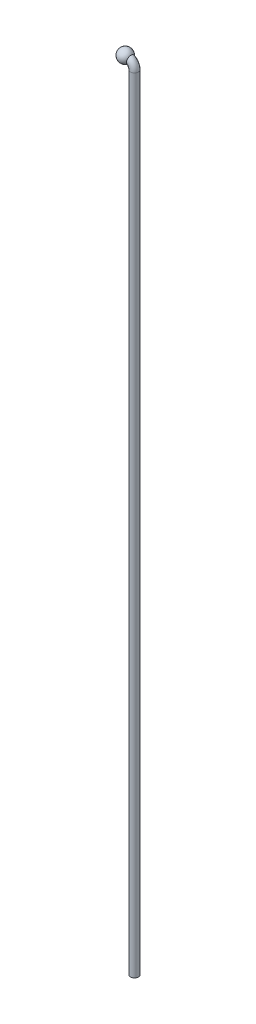
ISO-10303-21;
HEADER;
FILE_DESCRIPTION(('STEP AP214'),'2;1');
FILE_NAME('part.step','',(''),(''),'','','');
FILE_SCHEMA(('AUTOMOTIVE_DESIGN { 1 0 10303 214 1 1 1 1 }'));
ENDSEC;
DATA;
#1=APPLICATION_CONTEXT('core data for automotive mechanical design processes');
#2=APPLICATION_PROTOCOL_DEFINITION('international standard','automotive_design',2000,#1);
#3=PRODUCT_CONTEXT('',#1,'mechanical');
#4=PRODUCT('Part','Part','',(#3));
#5=PRODUCT_RELATED_PRODUCT_CATEGORY('part','',(#4));
#6=PRODUCT_DEFINITION_FORMATION('','',#4);
#7=PRODUCT_DEFINITION_CONTEXT('part definition',#1,'design');
#8=PRODUCT_DEFINITION('design','',#6,#7);
#9=PRODUCT_DEFINITION_SHAPE('','',#8);
#10=(LENGTH_UNIT() NAMED_UNIT(*) SI_UNIT(.MILLI.,.METRE.));
#11=(NAMED_UNIT(*) PLANE_ANGLE_UNIT() SI_UNIT($,.RADIAN.));
#12=(NAMED_UNIT(*) SI_UNIT($,.STERADIAN.) SOLID_ANGLE_UNIT());
#13=UNCERTAINTY_MEASURE_WITH_UNIT(LENGTH_MEASURE(1.E-05),#10,'distance_accuracy_value','');
#14=(GEOMETRIC_REPRESENTATION_CONTEXT(3) GLOBAL_UNCERTAINTY_ASSIGNED_CONTEXT((#13)) GLOBAL_UNIT_ASSIGNED_CONTEXT((#10,
#11,#12)) REPRESENTATION_CONTEXT('',''));
#15=CARTESIAN_POINT('',(0.,0.,0.));
#16=DIRECTION('',(0.,0.,1.));
#17=DIRECTION('',(1.,0.,0.));
#18=AXIS2_PLACEMENT_3D('',#15,#16,#17);
#19=CARTESIAN_POINT('',(0.,0.,0.));
#20=DIRECTION('',(0.,1.,0.));
#21=DIRECTION('',(0.,0.,1.));
#22=AXIS2_PLACEMENT_3D('',#19,#20,#21);
#23=SPHERICAL_SURFACE('',#22,0.25);
#24=CARTESIAN_POINT('',(0.162726043616397,-0.176506303465808,-0.0697549967084108));
#25=CARTESIAN_POINT('',(0.161563366562526,-0.180246009617506,-0.0630043114332008));
#26=CARTESIAN_POINT('',(0.160531558492117,-0.183469334110586,-0.0559424528707021));
#27=CARTESIAN_POINT('',(0.158812690152927,-0.188757003173833,-0.0413550538502256));
#28=CARTESIAN_POINT('',(0.15812562247858,-0.190821372640288,-0.0338295233565486));
#29=CARTESIAN_POINT('',(0.157161923105255,-0.193698830920512,-0.0184961581809773));
#30=CARTESIAN_POINT('',(0.156886286011589,-0.194508887694955,-0.0106876859845364));
#31=CARTESIAN_POINT('',(0.156778971229046,-0.194825515581641,0.00495795742018598));
#32=CARTESIAN_POINT('',(0.156947224597597,-0.19433228911249,0.0127951239830226));
#33=CARTESIAN_POINT('',(0.157695968154627,-0.19210698854907,0.028002081760782));
#34=CARTESIAN_POINT('',(0.158262583710984,-0.190416596601656,0.035378751033555));
#35=CARTESIAN_POINT('',(0.159739041612815,-0.185919305455527,0.0497461877987123));
#36=CARTESIAN_POINT('',(0.160648959366539,-0.183112160948478,0.0567368701198831));
#37=CARTESIAN_POINT('',(0.162779359054923,-0.176361884020417,0.0704347366936141));
#38=CARTESIAN_POINT('',(0.164010419541652,-0.172379289555845,0.0771207447870234));
#39=CARTESIAN_POINT('',(0.166679759251424,-0.163461796762754,0.0897767399818754));
#40=CARTESIAN_POINT('',(0.168118106458252,-0.158526585823872,0.0957464909908959));
#41=CARTESIAN_POINT('',(0.17126427740504,-0.147350908661414,0.107376789835914));
#42=CARTESIAN_POINT('',(0.172984716958165,-0.141032269760351,0.112958853432314));
#43=CARTESIAN_POINT('',(0.176501142539122,-0.127601703997334,0.123039922417289));
#44=CARTESIAN_POINT('',(0.178297155604893,-0.120489491689412,0.127538536242603));
#45=CARTESIAN_POINT('',(0.182032640210445,-0.10510896278946,0.135649910084866));
#46=CARTESIAN_POINT('',(0.183973041839435,-0.096794180407109,0.139174401930101));
#47=CARTESIAN_POINT('',(0.187807887045999,-0.079682706180449,0.144788358719007));
#48=CARTESIAN_POINT('',(0.189702322092231,-0.070885925850205,0.146877559210149));
#49=CARTESIAN_POINT('',(0.193446887692966,-0.0528207042392139,0.149590660979882));
#50=CARTESIAN_POINT('',(0.195294683461684,-0.0435459604271764,0.150176138642837));
#51=CARTESIAN_POINT('',(0.198856750427026,-0.0250084606289179,0.14973207824344));
#52=CARTESIAN_POINT('',(0.200571025908977,-0.0157457042673512,0.14870259203572));
#53=CARTESIAN_POINT('',(0.203813020613599,0.00235203869812955,0.145056103947357));
#54=CARTESIAN_POINT('',(0.205343095494062,0.0111912932364231,0.14246246786142));
#55=CARTESIAN_POINT('',(0.208222695968244,0.0283039832901261,0.13575230415777));
#56=CARTESIAN_POINT('',(0.209572254928478,0.0365775232334878,0.131636058509917));
#57=CARTESIAN_POINT('',(0.212027895460002,0.0519990121489633,0.122150504044118));
#58=CARTESIAN_POINT('',(0.213140957553433,0.0591766306254014,0.11683126385777));
#59=CARTESIAN_POINT('',(0.215168904743747,0.0725064733184893,0.105002507569269));
#60=CARTESIAN_POINT('',(0.2160838363215,0.0786589379551342,0.0984932712991665));
#61=CARTESIAN_POINT('',(0.217672374617806,0.0894999709079249,0.0847504369282391));
#62=CARTESIAN_POINT('',(0.218354159514686,0.094237187986466,0.0775561472250814));
#63=CARTESIAN_POINT('',(0.219517772918035,0.102404013550833,0.0624453127640316));
#64=CARTESIAN_POINT('',(0.21999964154241,0.105833884375228,0.0545289133038016));
#65=CARTESIAN_POINT('',(0.220746021926841,0.111177358601824,0.0384735346293333));
#66=CARTESIAN_POINT('',(0.221017015155765,0.11313610582569,0.0303498606389819));
#67=CARTESIAN_POINT('',(0.22136404133295,0.115648395252503,0.0138842106050686));
#68=CARTESIAN_POINT('',(0.221440097944852,0.116202108014552,0.00554226118248762));
#69=CARTESIAN_POINT('',(0.221396887360512,0.115888331809055,-0.0109692731057489));
#70=CARTESIAN_POINT('',(0.221280976252818,0.115045262089184,-0.0191393433672382));
#71=CARTESIAN_POINT('',(0.220861363261732,0.112012437418005,-0.0352201342863551));
#72=CARTESIAN_POINT('',(0.220557666691733,0.109822720570116,-0.0431308622754089));
#73=CARTESIAN_POINT('',(0.219765428810999,0.104167915710287,-0.0584741531364456));
#74=CARTESIAN_POINT('',(0.219276841766726,0.100702512156954,-0.0659065971699738));
#75=CARTESIAN_POINT('',(0.21811969368399,0.092607512094961,-0.0800917089376703));
#76=CARTESIAN_POINT('',(0.21745112237614,0.0879778491579879,-0.0868443378533195));
#77=CARTESIAN_POINT('',(0.215927582321257,0.0776086500834724,-0.0996068061735705));
#78=CARTESIAN_POINT('',(0.215069609541606,0.0718514182782227,-0.105601897035951));
#79=CARTESIAN_POINT('',(0.213183017499923,0.0594555451814283,-0.116565087128234));
#80=CARTESIAN_POINT('',(0.212154376479886,0.052816791528769,-0.121533055231585));
#81=CARTESIAN_POINT('',(0.209902951714473,0.0386345020963495,-0.130467613657852));
#82=CARTESIAN_POINT('',(0.20867517364004,0.0310694326835171,-0.134398743193406));
#83=CARTESIAN_POINT('',(0.206063651275647,0.0154249224410316,-0.14097369933551));
#84=CARTESIAN_POINT('',(0.204679879332963,0.00734539052444251,-0.143617297260591));
#85=CARTESIAN_POINT('',(0.201717533206708,-0.00942395947681427,-0.147650498793684));
#86=CARTESIAN_POINT('',(0.200133528214382,-0.0181252997637988,-0.148988201075906));
#87=CARTESIAN_POINT('',(0.196838912236741,-0.035605372884119,-0.150220582873029));
#88=CARTESIAN_POINT('',(0.195128280766187,-0.0443841180365297,-0.150115028392654));
#89=CARTESIAN_POINT('',(0.191545214089806,-0.0621069677755994,-0.148453826924659));
#90=CARTESIAN_POINT('',(0.189669151656967,-0.0710454076092231,-0.146845377357141));
#91=CARTESIAN_POINT('',(0.18585367207668,-0.0885166245495613,-0.142157333302758));
#92=CARTESIAN_POINT('',(0.18391423162755,-0.0970492495570906,-0.139077191930452));
#93=CARTESIAN_POINT('',(0.179986517679765,-0.113648020617271,-0.131446270377344));
#94=CARTESIAN_POINT('',(0.17799807909247,-0.121700479445111,-0.126865756940213));
#95=CARTESIAN_POINT('',(0.174092258724253,-0.136893990039022,-0.116365192133179));
#96=CARTESIAN_POINT('',(0.172174820792671,-0.144035773427523,-0.110446226794072));
#97=CARTESIAN_POINT('',(0.168931442071151,-0.155676491496073,-0.0988947145176962));
#98=CARTESIAN_POINT('',(0.167570199217656,-0.160406990181818,-0.0935035575604066));
#99=CARTESIAN_POINT('',(0.165010028773089,-0.169076832261374,-0.0820834657591227));
#100=CARTESIAN_POINT('',(0.16381105196407,-0.173016415728774,-0.0760547252974719));
#101=CARTESIAN_POINT('',(0.162726043616397,-0.176506303465808,-0.0697549967084108));
#102=B_SPLINE_CURVE_WITH_KNOTS('',3,(#24,#25,#26,#27,#28,#29,#30,#31,#32,#33,#34,#35,#36,#37,
#38,#39,#40,#41,#42,#43,#44,#45,#46,#47,#48,#49,#50,#51,#52,#53,#54,#55,#56,#57,#58,#59,#60,#61,
#62,#63,#64,#65,#66,#67,#68,#69,#70,#71,#72,#73,#74,#75,#76,#77,#78,#79,#80,#81,#82,#83,#84,#85,
#86,#87,#88,#89,#90,#91,#92,#93,#94,#95,#96,#97,#98,#99,#100,#101),.UNSPECIFIED.,.T.,.F.,(4,2,2,
2,2,2,2,2,2,2,2,2,2,2,2,2,2,2,2,2,2,2,2,2,2,2,2,2,2,2,2,2,2,2,2,2,2,2,4),(0.,0.0233900769338188,
0.0467796513905391,0.0702256774856684,0.0936680622902258,0.116331998577764,0.139000916026943,
0.162539812837054,0.186086447338061,0.211791156341201,0.237505141239753,0.265090037418662,
0.292680014754442,0.320968269108393,0.349255615177606,0.37713051474772,0.405000254787798,
0.431873457033248,0.458740348053741,0.484534308691933,0.51032309065804,0.535283937104042,
0.560241753372945,0.58476783184596,0.609293216384835,0.633824671363715,0.658357526333929,
0.68331171390143,0.708269085254657,0.733993339950457,0.759722161925956,0.786436317868153,
0.813154805028836,0.840848791648262,0.868553077456105,0.896843454879678,0.925110959108361,
0.946945178692739,0.968772760686736),.UNSPECIFIED.);
#103=CARTESIAN_POINT('',(0.162726043616397,-0.176506303465808,-0.0697549967084108));
#104=VERTEX_POINT('',#103);
#105=EDGE_CURVE('E10',#104,#104,#102,.T.);
#106=ORIENTED_EDGE('',*,*,#105,.T.);
#107=EDGE_LOOP('',(#106));
#108=FACE_BOUND('',#107,.T.);
#109=ADVANCED_FACE('F35',(#108),#23,.T.);
#110=CARTESIAN_POINT('',(0.05,-0.3,0.));
#111=DIRECTION('',(0.,0.,-1.));
#112=DIRECTION('',(-1.,0.,0.));
#113=AXIS2_PLACEMENT_3D('',#110,#111,#112);
#114=TOROIDAL_SURFACE('',#113,0.3,0.15);
#115=ORIENTED_EDGE('',*,*,#105,.F.);
#116=EDGE_LOOP('',(#115));
#117=FACE_BOUND('',#116,.T.);
#118=CARTESIAN_POINT('',(0.35,-0.3,0.));
#119=DIRECTION('',(0.,-1.,0.));
#120=DIRECTION('',(0.,0.,-1.));
#121=AXIS2_PLACEMENT_3D('',#118,#119,#120);
#122=CIRCLE('',#121,0.15);
#123=CARTESIAN_POINT('',(0.35,-0.3,-0.15));
#124=VERTEX_POINT('',#123);
#125=EDGE_CURVE('E47',#124,#124,#122,.T.);
#126=ORIENTED_EDGE('',*,*,#125,.F.);
#127=EDGE_LOOP('',(#126));
#128=FACE_BOUND('',#127,.T.);
#129=ADVANCED_FACE('F51',(#117,#128),#114,.T.);
#130=CARTESIAN_POINT('',(0.35,-0.3,0.));
#131=DIRECTION('',(0.,-1.,0.));
#132=DIRECTION('',(1.,0.,0.));
#133=AXIS2_PLACEMENT_3D('',#130,#131,#132);
#134=CYLINDRICAL_SURFACE('',#133,0.15);
#135=ORIENTED_EDGE('',*,*,#125,.T.);
#136=EDGE_LOOP('',(#135));
#137=FACE_BOUND('',#136,.T.);
#138=CARTESIAN_POINT('',(0.350000000000004,-30.,0.));
#139=DIRECTION('',(0.,-1.,0.));
#140=DIRECTION('',(0.,0.,-1.));
#141=AXIS2_PLACEMENT_3D('',#138,#139,#140);
#142=CIRCLE('',#141,0.15);
#143=CARTESIAN_POINT('',(0.350000000000004,-30.,-0.15));
#144=VERTEX_POINT('',#143);
#145=EDGE_CURVE('E39',#144,#144,#142,.T.);
#146=ORIENTED_EDGE('',*,*,#145,.F.);
#147=EDGE_LOOP('',(#146));
#148=FACE_BOUND('',#147,.T.);
#149=ADVANCED_FACE('F37',(#137,#148),#134,.T.);
#150=CARTESIAN_POINT('',(0.350000000000004,-30.,0.));
#151=DIRECTION('',(0.,-1.,0.));
#152=DIRECTION('',(0.,0.,-1.));
#153=AXIS2_PLACEMENT_3D('',#150,#151,#152);
#154=PLANE('',#153);
#155=ORIENTED_EDGE('',*,*,#145,.T.);
#156=EDGE_LOOP('',(#155));
#157=FACE_BOUND('',#156,.T.);
#158=ADVANCED_FACE('F56',(#157),#154,.T.);
#159=CLOSED_SHELL('',(#109,#129,#149,#158));
#160=MANIFOLD_SOLID_BREP('B2',#159);
#161=ADVANCED_BREP_SHAPE_REPRESENTATION('',(#18,#160),#14);
#162=SHAPE_DEFINITION_REPRESENTATION(#9,#161);
ENDSEC;
END-ISO-10303-21;
